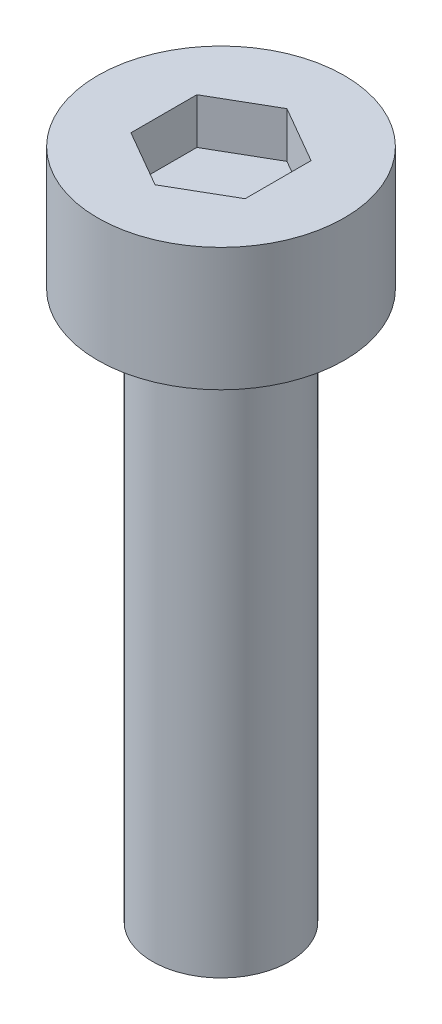
ISO-10303-21;
HEADER;
FILE_DESCRIPTION(('STEP AP214'),'2;1');
FILE_NAME('part.step','',(''),(''),'','','');
FILE_SCHEMA(('AUTOMOTIVE_DESIGN { 1 0 10303 214 1 1 1 1 }'));
ENDSEC;
DATA;
#1=APPLICATION_CONTEXT('core data for automotive mechanical design processes');
#2=APPLICATION_PROTOCOL_DEFINITION('international standard','automotive_design',2000,#1);
#3=PRODUCT_CONTEXT('',#1,'mechanical');
#4=PRODUCT('Part','Part','',(#3));
#5=PRODUCT_RELATED_PRODUCT_CATEGORY('part','',(#4));
#6=PRODUCT_DEFINITION_FORMATION('','',#4);
#7=PRODUCT_DEFINITION_CONTEXT('part definition',#1,'design');
#8=PRODUCT_DEFINITION('design','',#6,#7);
#9=PRODUCT_DEFINITION_SHAPE('','',#8);
#10=(LENGTH_UNIT() NAMED_UNIT(*) SI_UNIT(.MILLI.,.METRE.));
#11=(NAMED_UNIT(*) PLANE_ANGLE_UNIT() SI_UNIT($,.RADIAN.));
#12=(NAMED_UNIT(*) SI_UNIT($,.STERADIAN.) SOLID_ANGLE_UNIT());
#13=UNCERTAINTY_MEASURE_WITH_UNIT(LENGTH_MEASURE(1.E-05),#10,'distance_accuracy_value','');
#14=(GEOMETRIC_REPRESENTATION_CONTEXT(3) GLOBAL_UNCERTAINTY_ASSIGNED_CONTEXT((#13)) GLOBAL_UNIT_ASSIGNED_CONTEXT((#10,
#11,#12)) REPRESENTATION_CONTEXT('',''));
#15=CARTESIAN_POINT('',(0.,0.,0.));
#16=DIRECTION('',(0.,0.,1.));
#17=DIRECTION('',(1.,0.,0.));
#18=AXIS2_PLACEMENT_3D('',#15,#16,#17);
#19=CARTESIAN_POINT('',(0.,2.7,0.));
#20=DIRECTION('',(0.,-1.,0.));
#21=DIRECTION('',(0.,0.,-1.));
#22=AXIS2_PLACEMENT_3D('',#19,#20,#21);
#23=CYLINDRICAL_SURFACE('',#22,2.7);
#24=CARTESIAN_POINT('',(0.,2.7,0.));
#25=DIRECTION('',(0.,1.,0.));
#26=DIRECTION('',(0.,0.,1.));
#27=AXIS2_PLACEMENT_3D('',#24,#25,#26);
#28=CIRCLE('',#27,2.7);
#29=CARTESIAN_POINT('',(0.,2.7,2.7));
#30=VERTEX_POINT('',#29);
#31=EDGE_CURVE('E44',#30,#30,#28,.T.);
#32=ORIENTED_EDGE('',*,*,#31,.F.);
#33=EDGE_LOOP('',(#32));
#34=FACE_BOUND('',#33,.T.);
#35=CARTESIAN_POINT('',(0.,0.,0.));
#36=DIRECTION('',(0.,1.,0.));
#37=DIRECTION('',(0.,0.,1.));
#38=AXIS2_PLACEMENT_3D('',#35,#36,#37);
#39=CIRCLE('',#38,2.7);
#40=CARTESIAN_POINT('',(0.,0.,2.7));
#41=VERTEX_POINT('',#40);
#42=EDGE_CURVE('E39',#41,#41,#39,.T.);
#43=ORIENTED_EDGE('',*,*,#42,.T.);
#44=EDGE_LOOP('',(#43));
#45=FACE_BOUND('',#44,.T.);
#46=ADVANCED_FACE('F36',(#34,#45),#23,.T.);
#47=CARTESIAN_POINT('',(0.,2.7,0.));
#48=DIRECTION('',(0.,1.,0.));
#49=DIRECTION('',(0.,0.,1.));
#50=AXIS2_PLACEMENT_3D('',#47,#48,#49);
#51=PLANE('',#50);
#52=DIRECTION('',(-0.866025403784439,0.,-0.5));
#53=VECTOR('',#52,1.);
#54=CARTESIAN_POINT('',(1.25,2.7,-0.721687836487033));
#55=LINE('',#54,#53);
#56=CARTESIAN_POINT('',(1.25,2.7,-0.721687836487033));
#57=VERTEX_POINT('',#56);
#58=CARTESIAN_POINT('',(0.,2.7,-1.44337567297407));
#59=VERTEX_POINT('',#58);
#60=EDGE_CURVE('E52',#57,#59,#55,.T.);
#61=ORIENTED_EDGE('',*,*,#60,.F.);
#62=DIRECTION('',(0.,0.,-1.));
#63=VECTOR('',#62,1.);
#64=CARTESIAN_POINT('',(1.25,2.7,0.721687836487031));
#65=LINE('',#64,#63);
#66=CARTESIAN_POINT('',(1.25,2.7,0.721687836487031));
#67=VERTEX_POINT('',#66);
#68=EDGE_CURVE('E136',#67,#57,#65,.T.);
#69=ORIENTED_EDGE('',*,*,#68,.F.);
#70=DIRECTION('',(0.866025403784439,0.,-0.5));
#71=VECTOR('',#70,1.);
#72=CARTESIAN_POINT('',(0.,2.7,1.44337567297406));
#73=LINE('',#72,#71);
#74=CARTESIAN_POINT('',(0.,2.7,1.44337567297406));
#75=VERTEX_POINT('',#74);
#76=EDGE_CURVE('E134',#75,#67,#73,.T.);
#77=ORIENTED_EDGE('',*,*,#76,.F.);
#78=DIRECTION('',(0.866025403784438,0.,0.5));
#79=VECTOR('',#78,1.);
#80=CARTESIAN_POINT('',(-1.25,2.7,0.721687836487032));
#81=LINE('',#80,#79);
#82=CARTESIAN_POINT('',(-1.25,2.7,0.721687836487032));
#83=VERTEX_POINT('',#82);
#84=EDGE_CURVE('E100',#83,#75,#81,.T.);
#85=ORIENTED_EDGE('',*,*,#84,.F.);
#86=DIRECTION('',(0.,0.,1.));
#87=VECTOR('',#86,1.);
#88=CARTESIAN_POINT('',(-1.25,2.7,-0.721687836487032));
#89=LINE('',#88,#87);
#90=CARTESIAN_POINT('',(-1.25,2.7,-0.721687836487032));
#91=VERTEX_POINT('',#90);
#92=EDGE_CURVE('E130',#91,#83,#89,.T.);
#93=ORIENTED_EDGE('',*,*,#92,.F.);
#94=DIRECTION('',(-0.866025403784439,0.,0.5));
#95=VECTOR('',#94,1.);
#96=CARTESIAN_POINT('',(0.,2.7,-1.44337567297407));
#97=LINE('',#96,#95);
#98=EDGE_CURVE('E126',#59,#91,#97,.T.);
#99=ORIENTED_EDGE('',*,*,#98,.F.);
#100=EDGE_LOOP('',(#61,#69,#77,#85,#93,#99));
#101=FACE_BOUND('',#100,.T.);
#102=ORIENTED_EDGE('',*,*,#31,.T.);
#103=EDGE_LOOP('',(#102));
#104=FACE_BOUND('',#103,.T.);
#105=ADVANCED_FACE('F154',(#101,#104),#51,.T.);
#106=CARTESIAN_POINT('',(0.,0.,0.));
#107=DIRECTION('',(0.,1.,0.));
#108=DIRECTION('',(0.,0.,1.));
#109=AXIS2_PLACEMENT_3D('',#106,#107,#108);
#110=PLANE('',#109);
#111=CARTESIAN_POINT('',(0.,0.,0.));
#112=DIRECTION('',(0.,-1.,0.));
#113=DIRECTION('',(0.,0.,-1.));
#114=AXIS2_PLACEMENT_3D('',#111,#112,#113);
#115=CIRCLE('',#114,1.5);
#116=CARTESIAN_POINT('',(0.,0.,-1.5));
#117=VERTEX_POINT('',#116);
#118=EDGE_CURVE('E11',#117,#117,#115,.T.);
#119=ORIENTED_EDGE('',*,*,#118,.F.);
#120=EDGE_LOOP('',(#119));
#121=FACE_BOUND('',#120,.T.);
#122=ORIENTED_EDGE('',*,*,#42,.F.);
#123=EDGE_LOOP('',(#122));
#124=FACE_BOUND('',#123,.T.);
#125=ADVANCED_FACE('F151',(#121,#124),#110,.F.);
#126=CARTESIAN_POINT('',(1.25,1.7,-0.721687836487033));
#127=DIRECTION('',(0.5,0.,-0.866025403784439));
#128=DIRECTION('',(-0.866025403784439,0.,-0.5));
#129=AXIS2_PLACEMENT_3D('',#126,#127,#128);
#130=PLANE('',#129);
#131=ORIENTED_EDGE('',*,*,#60,.T.);
#132=DIRECTION('',(0.,1.,0.));
#133=VECTOR('',#132,1.);
#134=CARTESIAN_POINT('',(0.,1.7,-1.44337567297407));
#135=LINE('',#134,#133);
#136=CARTESIAN_POINT('',(0.,1.7,-1.44337567297407));
#137=VERTEX_POINT('',#136);
#138=EDGE_CURVE('E82',#137,#59,#135,.T.);
#139=ORIENTED_EDGE('',*,*,#138,.F.);
#140=DIRECTION('',(-0.866025403784439,0.,-0.5));
#141=VECTOR('',#140,1.);
#142=CARTESIAN_POINT('',(1.25,1.7,-0.721687836487033));
#143=LINE('',#142,#141);
#144=CARTESIAN_POINT('',(1.25,1.7,-0.721687836487033));
#145=VERTEX_POINT('',#144);
#146=EDGE_CURVE('E138',#145,#137,#143,.T.);
#147=ORIENTED_EDGE('',*,*,#146,.F.);
#148=DIRECTION('',(0.,1.,0.));
#149=VECTOR('',#148,1.);
#150=CARTESIAN_POINT('',(1.25,1.7,-0.721687836487033));
#151=LINE('',#150,#149);
#152=EDGE_CURVE('E60',#145,#57,#151,.T.);
#153=ORIENTED_EDGE('',*,*,#152,.T.);
#154=EDGE_LOOP('',(#131,#139,#147,#153));
#155=FACE_BOUND('',#154,.T.);
#156=ADVANCED_FACE('F153',(#155),#130,.F.);
#157=CARTESIAN_POINT('',(1.25,1.7,0.721687836487031));
#158=DIRECTION('',(1.,0.,0.));
#159=DIRECTION('',(0.,0.,-1.));
#160=AXIS2_PLACEMENT_3D('',#157,#158,#159);
#161=PLANE('',#160);
#162=ORIENTED_EDGE('',*,*,#68,.T.);
#163=ORIENTED_EDGE('',*,*,#152,.F.);
#164=DIRECTION('',(0.,0.,-1.));
#165=VECTOR('',#164,1.);
#166=CARTESIAN_POINT('',(1.25,1.7,0.721687836487031));
#167=LINE('',#166,#165);
#168=CARTESIAN_POINT('',(1.25,1.7,0.721687836487031));
#169=VERTEX_POINT('',#168);
#170=EDGE_CURVE('E112',#169,#145,#167,.T.);
#171=ORIENTED_EDGE('',*,*,#170,.F.);
#172=DIRECTION('',(0.,1.,0.));
#173=VECTOR('',#172,1.);
#174=CARTESIAN_POINT('',(1.25,1.7,0.721687836487031));
#175=LINE('',#174,#173);
#176=EDGE_CURVE('E104',#169,#67,#175,.T.);
#177=ORIENTED_EDGE('',*,*,#176,.T.);
#178=EDGE_LOOP('',(#162,#163,#171,#177));
#179=FACE_BOUND('',#178,.T.);
#180=ADVANCED_FACE('F160',(#179),#161,.F.);
#181=CARTESIAN_POINT('',(0.,1.7,1.44337567297406));
#182=DIRECTION('',(0.5,0.,0.866025403784439));
#183=DIRECTION('',(0.866025403784439,0.,-0.5));
#184=AXIS2_PLACEMENT_3D('',#181,#182,#183);
#185=PLANE('',#184);
#186=ORIENTED_EDGE('',*,*,#76,.T.);
#187=ORIENTED_EDGE('',*,*,#176,.F.);
#188=DIRECTION('',(0.866025403784439,0.,-0.5));
#189=VECTOR('',#188,1.);
#190=CARTESIAN_POINT('',(0.,1.7,1.44337567297406));
#191=LINE('',#190,#189);
#192=CARTESIAN_POINT('',(0.,1.7,1.44337567297406));
#193=VERTEX_POINT('',#192);
#194=EDGE_CURVE('E108',#193,#169,#191,.T.);
#195=ORIENTED_EDGE('',*,*,#194,.F.);
#196=DIRECTION('',(0.,1.,0.));
#197=VECTOR('',#196,1.);
#198=CARTESIAN_POINT('',(0.,1.7,1.44337567297406));
#199=LINE('',#198,#197);
#200=EDGE_CURVE('E93',#193,#75,#199,.T.);
#201=ORIENTED_EDGE('',*,*,#200,.T.);
#202=EDGE_LOOP('',(#186,#187,#195,#201));
#203=FACE_BOUND('',#202,.T.);
#204=ADVANCED_FACE('F109',(#203),#185,.F.);
#205=CARTESIAN_POINT('',(-1.25,1.7,0.721687836487032));
#206=DIRECTION('',(-0.5,0.,0.866025403784438));
#207=DIRECTION('',(0.866025403784438,0.,0.5));
#208=AXIS2_PLACEMENT_3D('',#205,#206,#207);
#209=PLANE('',#208);
#210=ORIENTED_EDGE('',*,*,#84,.T.);
#211=ORIENTED_EDGE('',*,*,#200,.F.);
#212=DIRECTION('',(0.866025403784438,0.,0.5));
#213=VECTOR('',#212,1.);
#214=CARTESIAN_POINT('',(-1.25,1.7,0.721687836487032));
#215=LINE('',#214,#213);
#216=CARTESIAN_POINT('',(-1.25,1.7,0.721687836487032));
#217=VERTEX_POINT('',#216);
#218=EDGE_CURVE('E97',#217,#193,#215,.T.);
#219=ORIENTED_EDGE('',*,*,#218,.F.);
#220=DIRECTION('',(0.,1.,0.));
#221=VECTOR('',#220,1.);
#222=CARTESIAN_POINT('',(-1.25,1.7,0.721687836487032));
#223=LINE('',#222,#221);
#224=EDGE_CURVE('E105',#217,#83,#223,.T.);
#225=ORIENTED_EDGE('',*,*,#224,.T.);
#226=EDGE_LOOP('',(#210,#211,#219,#225));
#227=FACE_BOUND('',#226,.T.);
#228=ADVANCED_FACE('F95',(#227),#209,.F.);
#229=CARTESIAN_POINT('',(-1.25,1.7,-0.721687836487032));
#230=DIRECTION('',(-1.,0.,0.));
#231=DIRECTION('',(0.,0.,1.));
#232=AXIS2_PLACEMENT_3D('',#229,#230,#231);
#233=PLANE('',#232);
#234=ORIENTED_EDGE('',*,*,#92,.T.);
#235=ORIENTED_EDGE('',*,*,#224,.F.);
#236=DIRECTION('',(0.,0.,1.));
#237=VECTOR('',#236,1.);
#238=CARTESIAN_POINT('',(-1.25,1.7,-0.721687836487032));
#239=LINE('',#238,#237);
#240=CARTESIAN_POINT('',(-1.25,1.7,-0.721687836487032));
#241=VERTEX_POINT('',#240);
#242=EDGE_CURVE('E118',#241,#217,#239,.T.);
#243=ORIENTED_EDGE('',*,*,#242,.F.);
#244=DIRECTION('',(0.,1.,0.));
#245=VECTOR('',#244,1.);
#246=CARTESIAN_POINT('',(-1.25,1.7,-0.721687836487032));
#247=LINE('',#246,#245);
#248=EDGE_CURVE('E142',#241,#91,#247,.T.);
#249=ORIENTED_EDGE('',*,*,#248,.T.);
#250=EDGE_LOOP('',(#234,#235,#243,#249));
#251=FACE_BOUND('',#250,.T.);
#252=ADVANCED_FACE('F209',(#251),#233,.F.);
#253=CARTESIAN_POINT('',(0.,1.7,-1.44337567297407));
#254=DIRECTION('',(-0.5,0.,-0.866025403784439));
#255=DIRECTION('',(-0.866025403784439,0.,0.5));
#256=AXIS2_PLACEMENT_3D('',#253,#254,#255);
#257=PLANE('',#256);
#258=ORIENTED_EDGE('',*,*,#98,.T.);
#259=ORIENTED_EDGE('',*,*,#248,.F.);
#260=DIRECTION('',(-0.866025403784439,0.,0.5));
#261=VECTOR('',#260,1.);
#262=CARTESIAN_POINT('',(0.,1.7,-1.44337567297407));
#263=LINE('',#262,#261);
#264=EDGE_CURVE('E120',#137,#241,#263,.T.);
#265=ORIENTED_EDGE('',*,*,#264,.F.);
#266=ORIENTED_EDGE('',*,*,#138,.T.);
#267=EDGE_LOOP('',(#258,#259,#265,#266));
#268=FACE_BOUND('',#267,.T.);
#269=ADVANCED_FACE('F219',(#268),#257,.F.);
#270=CARTESIAN_POINT('',(0.,1.7,0.));
#271=DIRECTION('',(0.,1.,0.));
#272=DIRECTION('',(0.,0.,1.));
#273=AXIS2_PLACEMENT_3D('',#270,#271,#272);
#274=PLANE('',#273);
#275=ORIENTED_EDGE('',*,*,#146,.T.);
#276=ORIENTED_EDGE('',*,*,#264,.T.);
#277=ORIENTED_EDGE('',*,*,#242,.T.);
#278=ORIENTED_EDGE('',*,*,#218,.T.);
#279=ORIENTED_EDGE('',*,*,#194,.T.);
#280=ORIENTED_EDGE('',*,*,#170,.T.);
#281=EDGE_LOOP('',(#275,#276,#277,#278,#279,#280));
#282=FACE_BOUND('',#281,.T.);
#283=ADVANCED_FACE('F115',(#282),#274,.T.);
#284=CARTESIAN_POINT('',(0.,-12.,0.));
#285=DIRECTION('',(0.,1.,0.));
#286=DIRECTION('',(0.,0.,1.));
#287=AXIS2_PLACEMENT_3D('',#284,#285,#286);
#288=CYLINDRICAL_SURFACE('',#287,1.5);
#289=CARTESIAN_POINT('',(0.,-12.,0.));
#290=DIRECTION('',(0.,-1.,0.));
#291=DIRECTION('',(0.,0.,-1.));
#292=AXIS2_PLACEMENT_3D('',#289,#290,#291);
#293=CIRCLE('',#292,1.5);
#294=CARTESIAN_POINT('',(0.,-12.,-1.5));
#295=VERTEX_POINT('',#294);
#296=EDGE_CURVE('E127',#295,#295,#293,.T.);
#297=ORIENTED_EDGE('',*,*,#296,.F.);
#298=EDGE_LOOP('',(#297));
#299=FACE_BOUND('',#298,.T.);
#300=ORIENTED_EDGE('',*,*,#118,.T.);
#301=EDGE_LOOP('',(#300));
#302=FACE_BOUND('',#301,.T.);
#303=ADVANCED_FACE('F239',(#299,#302),#288,.T.);
#304=CARTESIAN_POINT('',(0.,-12.,0.));
#305=DIRECTION('',(0.,-1.,0.));
#306=DIRECTION('',(0.,0.,-1.));
#307=AXIS2_PLACEMENT_3D('',#304,#305,#306);
#308=PLANE('',#307);
#309=ORIENTED_EDGE('',*,*,#296,.T.);
#310=EDGE_LOOP('',(#309));
#311=FACE_BOUND('',#310,.T.);
#312=ADVANCED_FACE('F254',(#311),#308,.T.);
#313=CLOSED_SHELL('',(#46,#105,#125,#156,#180,#204,#228,#252,#269,#283,#303,#312));
#314=MANIFOLD_SOLID_BREP('B2',#313);
#315=ADVANCED_BREP_SHAPE_REPRESENTATION('',(#18,#314),#14);
#316=SHAPE_DEFINITION_REPRESENTATION(#9,#315);
ENDSEC;
END-ISO-10303-21;
